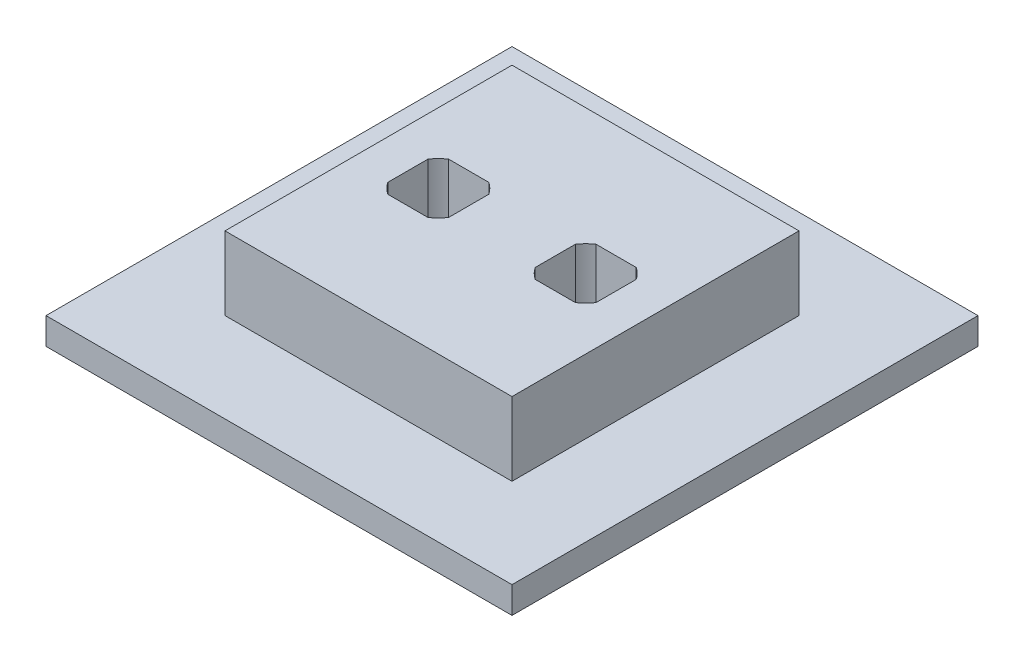
ISO-10303-21;
HEADER;
FILE_DESCRIPTION(('STEP AP214'),'2;1');
FILE_NAME('part.step','',(''),(''),'','','');
FILE_SCHEMA(('AUTOMOTIVE_DESIGN { 1 0 10303 214 1 1 1 1 }'));
ENDSEC;
DATA;
#1=APPLICATION_CONTEXT('core data for automotive mechanical design processes');
#2=APPLICATION_PROTOCOL_DEFINITION('international standard','automotive_design',2000,#1);
#3=PRODUCT_CONTEXT('',#1,'mechanical');
#4=PRODUCT('Part','Part','',(#3));
#5=PRODUCT_RELATED_PRODUCT_CATEGORY('part','',(#4));
#6=PRODUCT_DEFINITION_FORMATION('','',#4);
#7=PRODUCT_DEFINITION_CONTEXT('part definition',#1,'design');
#8=PRODUCT_DEFINITION('design','',#6,#7);
#9=PRODUCT_DEFINITION_SHAPE('','',#8);
#10=(LENGTH_UNIT() NAMED_UNIT(*) SI_UNIT(.MILLI.,.METRE.));
#11=(NAMED_UNIT(*) PLANE_ANGLE_UNIT() SI_UNIT($,.RADIAN.));
#12=(NAMED_UNIT(*) SI_UNIT($,.STERADIAN.) SOLID_ANGLE_UNIT());
#13=UNCERTAINTY_MEASURE_WITH_UNIT(LENGTH_MEASURE(1.E-05),#10,'distance_accuracy_value','');
#14=(GEOMETRIC_REPRESENTATION_CONTEXT(3) GLOBAL_UNCERTAINTY_ASSIGNED_CONTEXT((#13)) GLOBAL_UNIT_ASSIGNED_CONTEXT((#10,
#11,#12)) REPRESENTATION_CONTEXT('',''));
#15=CARTESIAN_POINT('',(0.,0.,0.));
#16=DIRECTION('',(0.,0.,1.));
#17=DIRECTION('',(1.,0.,0.));
#18=AXIS2_PLACEMENT_3D('',#15,#16,#17);
#19=CARTESIAN_POINT('',(23.876,15.,-34.925));
#20=DIRECTION('',(0.,-1.,0.));
#21=DIRECTION('',(0.,0.,-1.));
#22=AXIS2_PLACEMENT_3D('',#19,#20,#21);
#23=CYLINDRICAL_SURFACE('',#22,5.46099999999999);
#24=CARTESIAN_POINT('',(23.876,15.,-34.925));
#25=DIRECTION('',(0.,1.,0.));
#26=DIRECTION('',(0.,0.,1.));
#27=AXIS2_PLACEMENT_3D('',#24,#25,#26);
#28=CIRCLE('',#27,5.46099999999999);
#29=CARTESIAN_POINT('',(20.8727018130062,15.,-39.486));
#30=VERTEX_POINT('',#29);
#31=CARTESIAN_POINT('',(19.315,15.,-37.9282981869937));
#32=VERTEX_POINT('',#31);
#33=EDGE_CURVE('E406',#30,#32,#28,.T.);
#34=ORIENTED_EDGE('',*,*,#33,.T.);
#35=DIRECTION('',(0.,-1.,0.));
#36=VECTOR('',#35,1.);
#37=CARTESIAN_POINT('',(19.315,15.,-37.9282981869937));
#38=LINE('',#37,#36);
#39=CARTESIAN_POINT('',(19.315,0.,-37.9282981869937));
#40=VERTEX_POINT('',#39);
#41=EDGE_CURVE('E11',#32,#40,#38,.T.);
#42=ORIENTED_EDGE('',*,*,#41,.T.);
#43=CARTESIAN_POINT('',(23.876,0.,-34.925));
#44=DIRECTION('',(0.,1.,0.));
#45=DIRECTION('',(0.,0.,1.));
#46=AXIS2_PLACEMENT_3D('',#43,#44,#45);
#47=CIRCLE('',#46,5.46099999999998);
#48=CARTESIAN_POINT('',(20.8727018130063,0.,-39.486));
#49=VERTEX_POINT('',#48);
#50=EDGE_CURVE('E485',#49,#40,#47,.T.);
#51=ORIENTED_EDGE('',*,*,#50,.F.);
#52=DIRECTION('',(0.,-1.,0.));
#53=VECTOR('',#52,1.);
#54=CARTESIAN_POINT('',(20.8727018130062,15.,-39.486));
#55=LINE('',#54,#53);
#56=EDGE_CURVE('E380',#49,#30,#55,.F.);
#57=ORIENTED_EDGE('',*,*,#56,.T.);
#58=EDGE_LOOP('',(#34,#42,#51,#57));
#59=FACE_BOUND('',#58,.T.);
#60=ADVANCED_FACE('F39',(#59),#23,.F.);
#61=CARTESIAN_POINT('',(19.315,0.,-31.9217018130063));
#62=VERTEX_POINT('',#61);
#63=CARTESIAN_POINT('',(20.8727018130062,0.,-30.364));
#64=VERTEX_POINT('',#63);
#65=EDGE_CURVE('E236',#62,#64,#47,.T.);
#66=ORIENTED_EDGE('',*,*,#65,.F.);
#67=DIRECTION('',(0.,-1.,0.));
#68=VECTOR('',#67,1.);
#69=CARTESIAN_POINT('',(19.315,15.,-31.9217018130062));
#70=LINE('',#69,#68);
#71=CARTESIAN_POINT('',(19.315,15.,-31.9217018130062));
#72=VERTEX_POINT('',#71);
#73=EDGE_CURVE('E48',#62,#72,#70,.F.);
#74=ORIENTED_EDGE('',*,*,#73,.T.);
#75=CARTESIAN_POINT('',(20.8727018130062,15.,-30.364));
#76=VERTEX_POINT('',#75);
#77=EDGE_CURVE('E246',#72,#76,#28,.T.);
#78=ORIENTED_EDGE('',*,*,#77,.T.);
#79=DIRECTION('',(0.,-1.,0.));
#80=VECTOR('',#79,1.);
#81=CARTESIAN_POINT('',(20.8727018130062,15.,-30.364));
#82=LINE('',#81,#80);
#83=EDGE_CURVE('E368',#76,#64,#82,.T.);
#84=ORIENTED_EDGE('',*,*,#83,.T.);
#85=EDGE_LOOP('',(#66,#74,#78,#84));
#86=FACE_BOUND('',#85,.T.);
#87=ADVANCED_FACE('F393',(#86),#23,.F.);
#88=CARTESIAN_POINT('',(28.437,15.,-37.9282981869937));
#89=VERTEX_POINT('',#88);
#90=CARTESIAN_POINT('',(26.8792981869938,15.,-39.486));
#91=VERTEX_POINT('',#90);
#92=EDGE_CURVE('E253',#89,#91,#28,.T.);
#93=ORIENTED_EDGE('',*,*,#92,.T.);
#94=DIRECTION('',(0.,-1.,0.));
#95=VECTOR('',#94,1.);
#96=CARTESIAN_POINT('',(26.8792981869938,15.,-39.486));
#97=LINE('',#96,#95);
#98=CARTESIAN_POINT('',(26.8792981869938,0.,-39.486));
#99=VERTEX_POINT('',#98);
#100=EDGE_CURVE('E384',#91,#99,#97,.T.);
#101=ORIENTED_EDGE('',*,*,#100,.T.);
#102=CARTESIAN_POINT('',(28.437,0.,-37.9282981869937));
#103=VERTEX_POINT('',#102);
#104=EDGE_CURVE('E482',#103,#99,#47,.T.);
#105=ORIENTED_EDGE('',*,*,#104,.F.);
#106=DIRECTION('',(0.,-1.,0.));
#107=VECTOR('',#106,1.);
#108=CARTESIAN_POINT('',(28.437,15.,-37.9282981869937));
#109=LINE('',#108,#107);
#110=EDGE_CURVE('E372',#103,#89,#109,.F.);
#111=ORIENTED_EDGE('',*,*,#110,.T.);
#112=EDGE_LOOP('',(#93,#101,#105,#111));
#113=FACE_BOUND('',#112,.T.);
#114=ADVANCED_FACE('F413',(#113),#23,.F.);
#115=CARTESIAN_POINT('',(26.8792981869938,15.,-30.364));
#116=VERTEX_POINT('',#115);
#117=CARTESIAN_POINT('',(28.437,15.,-31.9217018130062));
#118=VERTEX_POINT('',#117);
#119=EDGE_CURVE('E248',#116,#118,#28,.T.);
#120=ORIENTED_EDGE('',*,*,#119,.T.);
#121=DIRECTION('',(0.,-1.,0.));
#122=VECTOR('',#121,1.);
#123=CARTESIAN_POINT('',(28.437,15.,-31.9217018130062));
#124=LINE('',#123,#122);
#125=CARTESIAN_POINT('',(28.437,0.,-31.9217018130062));
#126=VERTEX_POINT('',#125);
#127=EDGE_CURVE('E376',#118,#126,#124,.T.);
#128=ORIENTED_EDGE('',*,*,#127,.T.);
#129=CARTESIAN_POINT('',(26.8792981869937,0.,-30.364));
#130=VERTEX_POINT('',#129);
#131=EDGE_CURVE('E240',#130,#126,#47,.T.);
#132=ORIENTED_EDGE('',*,*,#131,.F.);
#133=DIRECTION('',(0.,-1.,0.));
#134=VECTOR('',#133,1.);
#135=CARTESIAN_POINT('',(26.8792981869938,15.,-30.364));
#136=LINE('',#135,#134);
#137=EDGE_CURVE('E364',#130,#116,#136,.F.);
#138=ORIENTED_EDGE('',*,*,#137,.T.);
#139=EDGE_LOOP('',(#120,#128,#132,#138));
#140=FACE_BOUND('',#139,.T.);
#141=ADVANCED_FACE('F505',(#140),#23,.F.);
#142=CARTESIAN_POINT('',(45.974,15.,-34.925));
#143=DIRECTION('',(0.,-1.,0.));
#144=DIRECTION('',(0.,0.,-1.));
#145=AXIS2_PLACEMENT_3D('',#142,#143,#144);
#146=CYLINDRICAL_SURFACE('',#145,5.46099999999998);
#147=CARTESIAN_POINT('',(45.974,15.,-34.925));
#148=DIRECTION('',(0.,1.,0.));
#149=DIRECTION('',(0.,0.,1.));
#150=AXIS2_PLACEMENT_3D('',#147,#148,#149);
#151=CIRCLE('',#150,5.46099999999998);
#152=CARTESIAN_POINT('',(42.9707018130063,15.,-39.486));
#153=VERTEX_POINT('',#152);
#154=CARTESIAN_POINT('',(41.413,15.,-37.9282981869937));
#155=VERTEX_POINT('',#154);
#156=EDGE_CURVE('E473',#153,#155,#151,.T.);
#157=ORIENTED_EDGE('',*,*,#156,.T.);
#158=DIRECTION('',(0.,-1.,0.));
#159=VECTOR('',#158,1.);
#160=CARTESIAN_POINT('',(41.413,15.,-37.9282981869937));
#161=LINE('',#160,#159);
#162=CARTESIAN_POINT('',(41.413,0.,-37.9282981869937));
#163=VERTEX_POINT('',#162);
#164=EDGE_CURVE('E360',#155,#163,#161,.T.);
#165=ORIENTED_EDGE('',*,*,#164,.T.);
#166=CARTESIAN_POINT('',(45.974,0.,-34.925));
#167=DIRECTION('',(0.,1.,0.));
#168=DIRECTION('',(0.,0.,1.));
#169=AXIS2_PLACEMENT_3D('',#166,#167,#168);
#170=CIRCLE('',#169,5.46099999999998);
#171=CARTESIAN_POINT('',(42.9707018130063,0.,-39.486));
#172=VERTEX_POINT('',#171);
#173=EDGE_CURVE('E232',#172,#163,#170,.T.);
#174=ORIENTED_EDGE('',*,*,#173,.F.);
#175=DIRECTION('',(0.,-1.,0.));
#176=VECTOR('',#175,1.);
#177=CARTESIAN_POINT('',(42.9707018130063,15.,-39.486));
#178=LINE('',#177,#176);
#179=EDGE_CURVE('E206',#172,#153,#178,.F.);
#180=ORIENTED_EDGE('',*,*,#179,.T.);
#181=EDGE_LOOP('',(#157,#165,#174,#180));
#182=FACE_BOUND('',#181,.T.);
#183=ADVANCED_FACE('F512',(#182),#146,.F.);
#184=CARTESIAN_POINT('',(41.413,0.,-31.9217018130062));
#185=VERTEX_POINT('',#184);
#186=CARTESIAN_POINT('',(42.9707018130063,0.,-30.364));
#187=VERTEX_POINT('',#186);
#188=EDGE_CURVE('E237',#185,#187,#170,.T.);
#189=ORIENTED_EDGE('',*,*,#188,.F.);
#190=DIRECTION('',(0.,-1.,0.));
#191=VECTOR('',#190,1.);
#192=CARTESIAN_POINT('',(41.413,15.,-31.9217018130062));
#193=LINE('',#192,#191);
#194=CARTESIAN_POINT('',(41.413,15.,-31.9217018130062));
#195=VERTEX_POINT('',#194);
#196=EDGE_CURVE('E224',#185,#195,#193,.F.);
#197=ORIENTED_EDGE('',*,*,#196,.T.);
#198=CARTESIAN_POINT('',(42.9707018130063,15.,-30.364));
#199=VERTEX_POINT('',#198);
#200=EDGE_CURVE('E247',#195,#199,#151,.T.);
#201=ORIENTED_EDGE('',*,*,#200,.T.);
#202=DIRECTION('',(0.,-1.,0.));
#203=VECTOR('',#202,1.);
#204=CARTESIAN_POINT('',(42.9707018130063,15.,-30.364));
#205=LINE('',#204,#203);
#206=EDGE_CURVE('E344',#199,#187,#205,.T.);
#207=ORIENTED_EDGE('',*,*,#206,.T.);
#208=EDGE_LOOP('',(#189,#197,#201,#207));
#209=FACE_BOUND('',#208,.T.);
#210=ADVANCED_FACE('F518',(#209),#146,.F.);
#211=CARTESIAN_POINT('',(50.535,15.,-37.9282981869937));
#212=VERTEX_POINT('',#211);
#213=CARTESIAN_POINT('',(48.9772981869937,15.,-39.486));
#214=VERTEX_POINT('',#213);
#215=EDGE_CURVE('E222',#212,#214,#151,.T.);
#216=ORIENTED_EDGE('',*,*,#215,.T.);
#217=DIRECTION('',(0.,-1.,0.));
#218=VECTOR('',#217,1.);
#219=CARTESIAN_POINT('',(48.9772981869937,15.,-39.486));
#220=LINE('',#219,#218);
#221=CARTESIAN_POINT('',(48.9772981869937,0.,-39.486));
#222=VERTEX_POINT('',#221);
#223=EDGE_CURVE('E203',#214,#222,#220,.T.);
#224=ORIENTED_EDGE('',*,*,#223,.T.);
#225=CARTESIAN_POINT('',(50.535,0.,-37.9282981869937));
#226=VERTEX_POINT('',#225);
#227=EDGE_CURVE('E220',#226,#222,#170,.T.);
#228=ORIENTED_EDGE('',*,*,#227,.F.);
#229=DIRECTION('',(0.,-1.,0.));
#230=VECTOR('',#229,1.);
#231=CARTESIAN_POINT('',(50.535,15.,-37.9282981869937));
#232=LINE('',#231,#230);
#233=EDGE_CURVE('E348',#226,#212,#232,.F.);
#234=ORIENTED_EDGE('',*,*,#233,.T.);
#235=EDGE_LOOP('',(#216,#224,#228,#234));
#236=FACE_BOUND('',#235,.T.);
#237=ADVANCED_FACE('F218',(#236),#146,.F.);
#238=CARTESIAN_POINT('',(48.9772981869937,15.,-30.364));
#239=VERTEX_POINT('',#238);
#240=CARTESIAN_POINT('',(50.535,15.,-31.9217018130063));
#241=VERTEX_POINT('',#240);
#242=EDGE_CURVE('E242',#239,#241,#151,.T.);
#243=ORIENTED_EDGE('',*,*,#242,.T.);
#244=DIRECTION('',(0.,-1.,0.));
#245=VECTOR('',#244,1.);
#246=CARTESIAN_POINT('',(50.535,15.,-31.9217018130063));
#247=LINE('',#246,#245);
#248=CARTESIAN_POINT('',(50.535,0.,-31.9217018130063));
#249=VERTEX_POINT('',#248);
#250=EDGE_CURVE('E351',#241,#249,#247,.T.);
#251=ORIENTED_EDGE('',*,*,#250,.T.);
#252=CARTESIAN_POINT('',(48.9772981869937,0.,-30.364));
#253=VERTEX_POINT('',#252);
#254=EDGE_CURVE('E231',#253,#249,#170,.T.);
#255=ORIENTED_EDGE('',*,*,#254,.F.);
#256=DIRECTION('',(0.,-1.,0.));
#257=VECTOR('',#256,1.);
#258=CARTESIAN_POINT('',(48.9772981869937,15.,-30.364));
#259=LINE('',#258,#257);
#260=EDGE_CURVE('E340',#253,#239,#259,.F.);
#261=ORIENTED_EDGE('',*,*,#260,.T.);
#262=EDGE_LOOP('',(#243,#251,#255,#261));
#263=FACE_BOUND('',#262,.T.);
#264=ADVANCED_FACE('F465',(#263),#146,.F.);
#265=CARTESIAN_POINT('',(0.,4.,0.));
#266=DIRECTION('',(1.,0.,0.));
#267=DIRECTION('',(0.,0.,-1.));
#268=AXIS2_PLACEMENT_3D('',#265,#266,#267);
#269=PLANE('',#268);
#270=DIRECTION('',(0.,0.,1.));
#271=VECTOR('',#270,1.);
#272=CARTESIAN_POINT('',(0.,0.,0.));
#273=LINE('',#272,#271);
#274=CARTESIAN_POINT('',(0.,0.,-69.85));
#275=VERTEX_POINT('',#274);
#276=CARTESIAN_POINT('',(0.,0.,0.));
#277=VERTEX_POINT('',#276);
#278=EDGE_CURVE('E298',#275,#277,#273,.T.);
#279=ORIENTED_EDGE('',*,*,#278,.T.);
#280=DIRECTION('',(0.,-1.,0.));
#281=VECTOR('',#280,1.);
#282=CARTESIAN_POINT('',(0.,4.,0.));
#283=LINE('',#282,#281);
#284=CARTESIAN_POINT('',(0.,4.,0.));
#285=VERTEX_POINT('',#284);
#286=EDGE_CURVE('E336',#285,#277,#283,.T.);
#287=ORIENTED_EDGE('',*,*,#286,.F.);
#288=DIRECTION('',(0.,0.,1.));
#289=VECTOR('',#288,1.);
#290=CARTESIAN_POINT('',(0.,4.,0.));
#291=LINE('',#290,#289);
#292=CARTESIAN_POINT('',(0.,4.,-69.85));
#293=VERTEX_POINT('',#292);
#294=EDGE_CURVE('E299',#293,#285,#291,.T.);
#295=ORIENTED_EDGE('',*,*,#294,.F.);
#296=DIRECTION('',(0.,-1.,0.));
#297=VECTOR('',#296,1.);
#298=CARTESIAN_POINT('',(0.,4.,-69.85));
#299=LINE('',#298,#297);
#300=EDGE_CURVE('E313',#293,#275,#299,.T.);
#301=ORIENTED_EDGE('',*,*,#300,.T.);
#302=EDGE_LOOP('',(#279,#287,#295,#301));
#303=FACE_BOUND('',#302,.T.);
#304=ADVANCED_FACE('F41',(#303),#269,.F.);
#305=CARTESIAN_POINT('',(0.,4.,0.));
#306=DIRECTION('',(0.,0.,-1.));
#307=DIRECTION('',(-1.,0.,0.));
#308=AXIS2_PLACEMENT_3D('',#305,#306,#307);
#309=PLANE('',#308);
#310=DIRECTION('',(1.,0.,0.));
#311=VECTOR('',#310,1.);
#312=CARTESIAN_POINT('',(0.,0.,0.));
#313=LINE('',#312,#311);
#314=CARTESIAN_POINT('',(69.85,0.,0.));
#315=VERTEX_POINT('',#314);
#316=EDGE_CURVE('E317',#277,#315,#313,.T.);
#317=ORIENTED_EDGE('',*,*,#316,.T.);
#318=DIRECTION('',(0.,-1.,0.));
#319=VECTOR('',#318,1.);
#320=CARTESIAN_POINT('',(69.85,4.,0.));
#321=LINE('',#320,#319);
#322=CARTESIAN_POINT('',(69.85,4.,0.));
#323=VERTEX_POINT('',#322);
#324=EDGE_CURVE('E332',#323,#315,#321,.T.);
#325=ORIENTED_EDGE('',*,*,#324,.F.);
#326=DIRECTION('',(1.,0.,0.));
#327=VECTOR('',#326,1.);
#328=CARTESIAN_POINT('',(0.,4.,0.));
#329=LINE('',#328,#327);
#330=EDGE_CURVE('E303',#285,#323,#329,.T.);
#331=ORIENTED_EDGE('',*,*,#330,.F.);
#332=ORIENTED_EDGE('',*,*,#286,.T.);
#333=EDGE_LOOP('',(#317,#325,#331,#332));
#334=FACE_BOUND('',#333,.T.);
#335=ADVANCED_FACE('F716',(#334),#309,.F.);
#336=CARTESIAN_POINT('',(69.85,4.,0.));
#337=DIRECTION('',(-1.,0.,0.));
#338=DIRECTION('',(0.,0.,1.));
#339=AXIS2_PLACEMENT_3D('',#336,#337,#338);
#340=PLANE('',#339);
#341=DIRECTION('',(0.,0.,-1.));
#342=VECTOR('',#341,1.);
#343=CARTESIAN_POINT('',(69.85,0.,0.));
#344=LINE('',#343,#342);
#345=CARTESIAN_POINT('',(69.85,0.,-69.85));
#346=VERTEX_POINT('',#345);
#347=EDGE_CURVE('E320',#315,#346,#344,.T.);
#348=ORIENTED_EDGE('',*,*,#347,.T.);
#349=DIRECTION('',(0.,-1.,0.));
#350=VECTOR('',#349,1.);
#351=CARTESIAN_POINT('',(69.85,4.,-69.85));
#352=LINE('',#351,#350);
#353=CARTESIAN_POINT('',(69.85,4.,-69.85));
#354=VERTEX_POINT('',#353);
#355=EDGE_CURVE('E328',#354,#346,#352,.T.);
#356=ORIENTED_EDGE('',*,*,#355,.F.);
#357=DIRECTION('',(0.,0.,-1.));
#358=VECTOR('',#357,1.);
#359=CARTESIAN_POINT('',(69.85,4.,0.));
#360=LINE('',#359,#358);
#361=EDGE_CURVE('E307',#323,#354,#360,.T.);
#362=ORIENTED_EDGE('',*,*,#361,.F.);
#363=ORIENTED_EDGE('',*,*,#324,.T.);
#364=EDGE_LOOP('',(#348,#356,#362,#363));
#365=FACE_BOUND('',#364,.T.);
#366=ADVANCED_FACE('F706',(#365),#340,.F.);
#367=CARTESIAN_POINT('',(0.,4.,-69.85));
#368=DIRECTION('',(0.,0.,1.));
#369=DIRECTION('',(1.,0.,0.));
#370=AXIS2_PLACEMENT_3D('',#367,#368,#369);
#371=PLANE('',#370);
#372=DIRECTION('',(-1.,0.,0.));
#373=VECTOR('',#372,1.);
#374=CARTESIAN_POINT('',(0.,0.,-69.85));
#375=LINE('',#374,#373);
#376=EDGE_CURVE('E304',#346,#275,#375,.T.);
#377=ORIENTED_EDGE('',*,*,#376,.T.);
#378=ORIENTED_EDGE('',*,*,#300,.F.);
#379=DIRECTION('',(-1.,0.,0.));
#380=VECTOR('',#379,1.);
#381=CARTESIAN_POINT('',(0.,4.,-69.85));
#382=LINE('',#381,#380);
#383=EDGE_CURVE('E310',#354,#293,#382,.T.);
#384=ORIENTED_EDGE('',*,*,#383,.F.);
#385=ORIENTED_EDGE('',*,*,#355,.T.);
#386=EDGE_LOOP('',(#377,#378,#384,#385));
#387=FACE_BOUND('',#386,.T.);
#388=ADVANCED_FACE('F696',(#387),#371,.F.);
#389=CARTESIAN_POINT('',(0.,4.,0.));
#390=DIRECTION('',(0.,-1.,0.));
#391=DIRECTION('',(0.,0.,-1.));
#392=AXIS2_PLACEMENT_3D('',#389,#390,#391);
#393=PLANE('',#392);
#394=DIRECTION('',(0.,0.,1.));
#395=VECTOR('',#394,1.);
#396=CARTESIAN_POINT('',(13.415,4.,-13.415));
#397=LINE('',#396,#395);
#398=CARTESIAN_POINT('',(13.415,4.,-56.435));
#399=VERTEX_POINT('',#398);
#400=CARTESIAN_POINT('',(13.415,4.,-13.415));
#401=VERTEX_POINT('',#400);
#402=EDGE_CURVE('E252',#399,#401,#397,.T.);
#403=ORIENTED_EDGE('',*,*,#402,.F.);
#404=DIRECTION('',(-1.,0.,0.));
#405=VECTOR('',#404,1.);
#406=CARTESIAN_POINT('',(13.415,4.,-56.435));
#407=LINE('',#406,#405);
#408=CARTESIAN_POINT('',(56.435,4.,-56.435));
#409=VERTEX_POINT('',#408);
#410=EDGE_CURVE('E259',#409,#399,#407,.T.);
#411=ORIENTED_EDGE('',*,*,#410,.F.);
#412=DIRECTION('',(0.,0.,-1.));
#413=VECTOR('',#412,1.);
#414=CARTESIAN_POINT('',(56.435,4.,-13.415));
#415=LINE('',#414,#413);
#416=CARTESIAN_POINT('',(56.435,4.,-13.415));
#417=VERTEX_POINT('',#416);
#418=EDGE_CURVE('E276',#417,#409,#415,.T.);
#419=ORIENTED_EDGE('',*,*,#418,.F.);
#420=DIRECTION('',(1.,0.,0.));
#421=VECTOR('',#420,1.);
#422=CARTESIAN_POINT('',(13.415,4.,-13.415));
#423=LINE('',#422,#421);
#424=EDGE_CURVE('E272',#401,#417,#423,.T.);
#425=ORIENTED_EDGE('',*,*,#424,.F.);
#426=EDGE_LOOP('',(#403,#411,#419,#425));
#427=FACE_BOUND('',#426,.T.);
#428=ORIENTED_EDGE('',*,*,#294,.T.);
#429=ORIENTED_EDGE('',*,*,#330,.T.);
#430=ORIENTED_EDGE('',*,*,#361,.T.);
#431=ORIENTED_EDGE('',*,*,#383,.T.);
#432=EDGE_LOOP('',(#428,#429,#430,#431));
#433=FACE_BOUND('',#432,.T.);
#434=ADVANCED_FACE('F593',(#427,#433),#393,.F.);
#435=CARTESIAN_POINT('',(0.,0.,0.));
#436=DIRECTION('',(0.,-1.,0.));
#437=DIRECTION('',(0.,0.,-1.));
#438=AXIS2_PLACEMENT_3D('',#435,#436,#437);
#439=PLANE('',#438);
#440=ORIENTED_EDGE('',*,*,#278,.F.);
#441=ORIENTED_EDGE('',*,*,#376,.F.);
#442=ORIENTED_EDGE('',*,*,#347,.F.);
#443=ORIENTED_EDGE('',*,*,#316,.F.);
#444=EDGE_LOOP('',(#440,#441,#442,#443));
#445=FACE_BOUND('',#444,.T.);
#446=DIRECTION('',(0.,0.,1.));
#447=VECTOR('',#446,1.);
#448=CARTESIAN_POINT('',(19.315,0.,-30.364));
#449=LINE('',#448,#447);
#450=EDGE_CURVE('E55',#40,#62,#449,.T.);
#451=ORIENTED_EDGE('',*,*,#450,.T.);
#452=ORIENTED_EDGE('',*,*,#65,.T.);
#453=DIRECTION('',(1.,0.,0.));
#454=VECTOR('',#453,1.);
#455=CARTESIAN_POINT('',(19.315,0.,-30.364));
#456=LINE('',#455,#454);
#457=EDGE_CURVE('E443',#64,#130,#456,.T.);
#458=ORIENTED_EDGE('',*,*,#457,.T.);
#459=ORIENTED_EDGE('',*,*,#131,.T.);
#460=DIRECTION('',(0.,0.,-1.));
#461=VECTOR('',#460,1.);
#462=CARTESIAN_POINT('',(28.437,0.,-30.364));
#463=LINE('',#462,#461);
#464=EDGE_CURVE('E446',#126,#103,#463,.T.);
#465=ORIENTED_EDGE('',*,*,#464,.T.);
#466=ORIENTED_EDGE('',*,*,#104,.T.);
#467=DIRECTION('',(-1.,0.,0.));
#468=VECTOR('',#467,1.);
#469=CARTESIAN_POINT('',(19.315,0.,-39.486));
#470=LINE('',#469,#468);
#471=EDGE_CURVE('E61',#99,#49,#470,.T.);
#472=ORIENTED_EDGE('',*,*,#471,.T.);
#473=ORIENTED_EDGE('',*,*,#50,.T.);
#474=EDGE_LOOP('',(#451,#452,#458,#459,#465,#466,#472,#473));
#475=FACE_BOUND('',#474,.T.);
#476=DIRECTION('',(0.,0.,1.));
#477=VECTOR('',#476,1.);
#478=CARTESIAN_POINT('',(41.413,0.,-39.486));
#479=LINE('',#478,#477);
#480=EDGE_CURVE('E212',#163,#185,#479,.T.);
#481=ORIENTED_EDGE('',*,*,#480,.T.);
#482=ORIENTED_EDGE('',*,*,#188,.T.);
#483=DIRECTION('',(1.,0.,0.));
#484=VECTOR('',#483,1.);
#485=CARTESIAN_POINT('',(41.413,0.,-30.364));
#486=LINE('',#485,#484);
#487=EDGE_CURVE('E450',#187,#253,#486,.T.);
#488=ORIENTED_EDGE('',*,*,#487,.T.);
#489=ORIENTED_EDGE('',*,*,#254,.T.);
#490=DIRECTION('',(0.,0.,-1.));
#491=VECTOR('',#490,1.);
#492=CARTESIAN_POINT('',(50.535,0.,-39.486));
#493=LINE('',#492,#491);
#494=EDGE_CURVE('E228',#249,#226,#493,.T.);
#495=ORIENTED_EDGE('',*,*,#494,.T.);
#496=ORIENTED_EDGE('',*,*,#227,.T.);
#497=DIRECTION('',(-1.,0.,0.));
#498=VECTOR('',#497,1.);
#499=CARTESIAN_POINT('',(41.413,0.,-39.486));
#500=LINE('',#499,#498);
#501=EDGE_CURVE('E200',#222,#172,#500,.T.);
#502=ORIENTED_EDGE('',*,*,#501,.T.);
#503=ORIENTED_EDGE('',*,*,#173,.T.);
#504=EDGE_LOOP('',(#481,#482,#488,#489,#495,#496,#502,#503));
#505=FACE_BOUND('',#504,.T.);
#506=ADVANCED_FACE('F226',(#445,#475,#505),#439,.T.);
#507=CARTESIAN_POINT('',(0.,15.,0.));
#508=DIRECTION('',(0.,-1.,0.));
#509=DIRECTION('',(0.,0.,-1.));
#510=AXIS2_PLACEMENT_3D('',#507,#508,#509);
#511=PLANE('',#510);
#512=ORIENTED_EDGE('',*,*,#77,.F.);
#513=DIRECTION('',(0.,0.,1.));
#514=VECTOR('',#513,1.);
#515=CARTESIAN_POINT('',(19.315,15.,-30.364));
#516=LINE('',#515,#514);
#517=EDGE_CURVE('E401',#32,#72,#516,.T.);
#518=ORIENTED_EDGE('',*,*,#517,.F.);
#519=ORIENTED_EDGE('',*,*,#33,.F.);
#520=DIRECTION('',(-1.,0.,0.));
#521=VECTOR('',#520,1.);
#522=CARTESIAN_POINT('',(19.315,15.,-39.486));
#523=LINE('',#522,#521);
#524=EDGE_CURVE('E419',#91,#30,#523,.T.);
#525=ORIENTED_EDGE('',*,*,#524,.F.);
#526=ORIENTED_EDGE('',*,*,#92,.F.);
#527=DIRECTION('',(0.,0.,-1.));
#528=VECTOR('',#527,1.);
#529=CARTESIAN_POINT('',(28.437,15.,-30.364));
#530=LINE('',#529,#528);
#531=EDGE_CURVE('E418',#118,#89,#530,.T.);
#532=ORIENTED_EDGE('',*,*,#531,.F.);
#533=ORIENTED_EDGE('',*,*,#119,.F.);
#534=DIRECTION('',(1.,0.,0.));
#535=VECTOR('',#534,1.);
#536=CARTESIAN_POINT('',(19.315,15.,-30.364));
#537=LINE('',#536,#535);
#538=EDGE_CURVE('E404',#76,#116,#537,.T.);
#539=ORIENTED_EDGE('',*,*,#538,.F.);
#540=EDGE_LOOP('',(#512,#518,#519,#525,#526,#532,#533,#539));
#541=FACE_BOUND('',#540,.T.);
#542=ORIENTED_EDGE('',*,*,#200,.F.);
#543=DIRECTION('',(0.,0.,1.));
#544=VECTOR('',#543,1.);
#545=CARTESIAN_POINT('',(41.413,15.,-39.486));
#546=LINE('',#545,#544);
#547=EDGE_CURVE('E429',#155,#195,#546,.T.);
#548=ORIENTED_EDGE('',*,*,#547,.F.);
#549=ORIENTED_EDGE('',*,*,#156,.F.);
#550=DIRECTION('',(-1.,0.,0.));
#551=VECTOR('',#550,1.);
#552=CARTESIAN_POINT('',(41.413,15.,-39.486));
#553=LINE('',#552,#551);
#554=EDGE_CURVE('E431',#214,#153,#553,.T.);
#555=ORIENTED_EDGE('',*,*,#554,.F.);
#556=ORIENTED_EDGE('',*,*,#215,.F.);
#557=DIRECTION('',(0.,0.,-1.));
#558=VECTOR('',#557,1.);
#559=CARTESIAN_POINT('',(50.535,15.,-39.486));
#560=LINE('',#559,#558);
#561=EDGE_CURVE('E434',#241,#212,#560,.T.);
#562=ORIENTED_EDGE('',*,*,#561,.F.);
#563=ORIENTED_EDGE('',*,*,#242,.F.);
#564=DIRECTION('',(1.,0.,0.));
#565=VECTOR('',#564,1.);
#566=CARTESIAN_POINT('',(41.413,15.,-30.364));
#567=LINE('',#566,#565);
#568=EDGE_CURVE('E213',#199,#239,#567,.T.);
#569=ORIENTED_EDGE('',*,*,#568,.F.);
#570=EDGE_LOOP('',(#542,#548,#549,#555,#556,#562,#563,#569));
#571=FACE_BOUND('',#570,.T.);
#572=DIRECTION('',(0.,0.,1.));
#573=VECTOR('',#572,1.);
#574=CARTESIAN_POINT('',(13.415,15.,-13.415));
#575=LINE('',#574,#573);
#576=CARTESIAN_POINT('',(13.415,15.,-56.435));
#577=VERTEX_POINT('',#576);
#578=CARTESIAN_POINT('',(13.415,15.,-13.415));
#579=VERTEX_POINT('',#578);
#580=EDGE_CURVE('E254',#577,#579,#575,.T.);
#581=ORIENTED_EDGE('',*,*,#580,.T.);
#582=DIRECTION('',(1.,0.,0.));
#583=VECTOR('',#582,1.);
#584=CARTESIAN_POINT('',(13.415,15.,-13.415));
#585=LINE('',#584,#583);
#586=CARTESIAN_POINT('',(56.435,15.,-13.415));
#587=VERTEX_POINT('',#586);
#588=EDGE_CURVE('E258',#579,#587,#585,.T.);
#589=ORIENTED_EDGE('',*,*,#588,.T.);
#590=DIRECTION('',(0.,0.,-1.));
#591=VECTOR('',#590,1.);
#592=CARTESIAN_POINT('',(56.435,15.,-13.415));
#593=LINE('',#592,#591);
#594=CARTESIAN_POINT('',(56.435,15.,-56.435));
#595=VERTEX_POINT('',#594);
#596=EDGE_CURVE('E262',#587,#595,#593,.T.);
#597=ORIENTED_EDGE('',*,*,#596,.T.);
#598=DIRECTION('',(-1.,0.,0.));
#599=VECTOR('',#598,1.);
#600=CARTESIAN_POINT('',(13.415,15.,-56.435));
#601=LINE('',#600,#599);
#602=EDGE_CURVE('E265',#595,#577,#601,.T.);
#603=ORIENTED_EDGE('',*,*,#602,.T.);
#604=EDGE_LOOP('',(#581,#589,#597,#603));
#605=FACE_BOUND('',#604,.T.);
#606=ADVANCED_FACE('F398',(#541,#571,#605),#511,.F.);
#607=CARTESIAN_POINT('',(13.415,15.,-13.415));
#608=DIRECTION('',(1.,0.,0.));
#609=DIRECTION('',(0.,0.,-1.));
#610=AXIS2_PLACEMENT_3D('',#607,#608,#609);
#611=PLANE('',#610);
#612=ORIENTED_EDGE('',*,*,#402,.T.);
#613=DIRECTION('',(0.,-1.,0.));
#614=VECTOR('',#613,1.);
#615=CARTESIAN_POINT('',(13.415,15.,-13.415));
#616=LINE('',#615,#614);
#617=EDGE_CURVE('E294',#579,#401,#616,.T.);
#618=ORIENTED_EDGE('',*,*,#617,.F.);
#619=ORIENTED_EDGE('',*,*,#580,.F.);
#620=DIRECTION('',(0.,-1.,0.));
#621=VECTOR('',#620,1.);
#622=CARTESIAN_POINT('',(13.415,15.,-56.435));
#623=LINE('',#622,#621);
#624=EDGE_CURVE('E268',#577,#399,#623,.T.);
#625=ORIENTED_EDGE('',*,*,#624,.T.);
#626=EDGE_LOOP('',(#612,#618,#619,#625));
#627=FACE_BOUND('',#626,.T.);
#628=ADVANCED_FACE('F583',(#627),#611,.F.);
#629=CARTESIAN_POINT('',(13.415,15.,-13.415));
#630=DIRECTION('',(0.,0.,-1.));
#631=DIRECTION('',(-1.,0.,0.));
#632=AXIS2_PLACEMENT_3D('',#629,#630,#631);
#633=PLANE('',#632);
#634=ORIENTED_EDGE('',*,*,#424,.T.);
#635=DIRECTION('',(0.,-1.,0.));
#636=VECTOR('',#635,1.);
#637=CARTESIAN_POINT('',(56.435,15.,-13.415));
#638=LINE('',#637,#636);
#639=EDGE_CURVE('E290',#587,#417,#638,.T.);
#640=ORIENTED_EDGE('',*,*,#639,.F.);
#641=ORIENTED_EDGE('',*,*,#588,.F.);
#642=ORIENTED_EDGE('',*,*,#617,.T.);
#643=EDGE_LOOP('',(#634,#640,#641,#642));
#644=FACE_BOUND('',#643,.T.);
#645=ADVANCED_FACE('F670',(#644),#633,.F.);
#646=CARTESIAN_POINT('',(56.435,15.,-13.415));
#647=DIRECTION('',(-1.,0.,0.));
#648=DIRECTION('',(0.,0.,1.));
#649=AXIS2_PLACEMENT_3D('',#646,#647,#648);
#650=PLANE('',#649);
#651=ORIENTED_EDGE('',*,*,#418,.T.);
#652=DIRECTION('',(0.,-1.,0.));
#653=VECTOR('',#652,1.);
#654=CARTESIAN_POINT('',(56.435,15.,-56.435));
#655=LINE('',#654,#653);
#656=EDGE_CURVE('E286',#595,#409,#655,.T.);
#657=ORIENTED_EDGE('',*,*,#656,.F.);
#658=ORIENTED_EDGE('',*,*,#596,.F.);
#659=ORIENTED_EDGE('',*,*,#639,.T.);
#660=EDGE_LOOP('',(#651,#657,#658,#659));
#661=FACE_BOUND('',#660,.T.);
#662=ADVANCED_FACE('F660',(#661),#650,.F.);
#663=CARTESIAN_POINT('',(13.415,15.,-56.435));
#664=DIRECTION('',(0.,0.,1.));
#665=DIRECTION('',(1.,0.,0.));
#666=AXIS2_PLACEMENT_3D('',#663,#664,#665);
#667=PLANE('',#666);
#668=ORIENTED_EDGE('',*,*,#410,.T.);
#669=ORIENTED_EDGE('',*,*,#624,.F.);
#670=ORIENTED_EDGE('',*,*,#602,.F.);
#671=ORIENTED_EDGE('',*,*,#656,.T.);
#672=EDGE_LOOP('',(#668,#669,#670,#671));
#673=FACE_BOUND('',#672,.T.);
#674=ADVANCED_FACE('F573',(#673),#667,.F.);
#675=CARTESIAN_POINT('',(41.413,-60.8394674532905,-39.486));
#676=DIRECTION('',(0.,0.,-1.));
#677=DIRECTION('',(-1.,0.,0.));
#678=AXIS2_PLACEMENT_3D('',#675,#676,#677);
#679=PLANE('',#678);
#680=ORIENTED_EDGE('',*,*,#223,.F.);
#681=ORIENTED_EDGE('',*,*,#554,.T.);
#682=ORIENTED_EDGE('',*,*,#179,.F.);
#683=ORIENTED_EDGE('',*,*,#501,.F.);
#684=EDGE_LOOP('',(#680,#681,#682,#683));
#685=FACE_BOUND('',#684,.T.);
#686=ADVANCED_FACE('F202',(#685),#679,.F.);
#687=CARTESIAN_POINT('',(41.413,-60.8394674532905,-39.486));
#688=DIRECTION('',(-1.,0.,0.));
#689=DIRECTION('',(0.,0.,1.));
#690=AXIS2_PLACEMENT_3D('',#687,#688,#689);
#691=PLANE('',#690);
#692=ORIENTED_EDGE('',*,*,#164,.F.);
#693=ORIENTED_EDGE('',*,*,#547,.T.);
#694=ORIENTED_EDGE('',*,*,#196,.F.);
#695=ORIENTED_EDGE('',*,*,#480,.F.);
#696=EDGE_LOOP('',(#692,#693,#694,#695));
#697=FACE_BOUND('',#696,.T.);
#698=ADVANCED_FACE('F556',(#697),#691,.F.);
#699=CARTESIAN_POINT('',(41.413,-60.8394674532905,-30.364));
#700=DIRECTION('',(0.,0.,1.));
#701=DIRECTION('',(1.,0.,0.));
#702=AXIS2_PLACEMENT_3D('',#699,#700,#701);
#703=PLANE('',#702);
#704=ORIENTED_EDGE('',*,*,#206,.F.);
#705=ORIENTED_EDGE('',*,*,#568,.T.);
#706=ORIENTED_EDGE('',*,*,#260,.F.);
#707=ORIENTED_EDGE('',*,*,#487,.F.);
#708=EDGE_LOOP('',(#704,#705,#706,#707));
#709=FACE_BOUND('',#708,.T.);
#710=ADVANCED_FACE('F461',(#709),#703,.F.);
#711=CARTESIAN_POINT('',(50.535,-60.8394674532905,-39.486));
#712=DIRECTION('',(1.,0.,0.));
#713=DIRECTION('',(0.,0.,-1.));
#714=AXIS2_PLACEMENT_3D('',#711,#712,#713);
#715=PLANE('',#714);
#716=ORIENTED_EDGE('',*,*,#250,.F.);
#717=ORIENTED_EDGE('',*,*,#561,.T.);
#718=ORIENTED_EDGE('',*,*,#233,.F.);
#719=ORIENTED_EDGE('',*,*,#494,.F.);
#720=EDGE_LOOP('',(#716,#717,#718,#719));
#721=FACE_BOUND('',#720,.T.);
#722=ADVANCED_FACE('F468',(#721),#715,.F.);
#723=CARTESIAN_POINT('',(19.315,-60.8394674532905,-39.486));
#724=DIRECTION('',(0.,0.,-1.));
#725=DIRECTION('',(-1.,0.,0.));
#726=AXIS2_PLACEMENT_3D('',#723,#724,#725);
#727=PLANE('',#726);
#728=ORIENTED_EDGE('',*,*,#100,.F.);
#729=ORIENTED_EDGE('',*,*,#524,.T.);
#730=ORIENTED_EDGE('',*,*,#56,.F.);
#731=ORIENTED_EDGE('',*,*,#471,.F.);
#732=EDGE_LOOP('',(#728,#729,#730,#731));
#733=FACE_BOUND('',#732,.T.);
#734=ADVANCED_FACE('F492',(#733),#727,.F.);
#735=CARTESIAN_POINT('',(19.315,-60.8394674532905,-30.364));
#736=DIRECTION('',(-1.,0.,0.));
#737=DIRECTION('',(0.,0.,1.));
#738=AXIS2_PLACEMENT_3D('',#735,#736,#737);
#739=PLANE('',#738);
#740=ORIENTED_EDGE('',*,*,#41,.F.);
#741=ORIENTED_EDGE('',*,*,#517,.T.);
#742=ORIENTED_EDGE('',*,*,#73,.F.);
#743=ORIENTED_EDGE('',*,*,#450,.F.);
#744=EDGE_LOOP('',(#740,#741,#742,#743));
#745=FACE_BOUND('',#744,.T.);
#746=ADVANCED_FACE('F489',(#745),#739,.F.);
#747=CARTESIAN_POINT('',(19.315,-60.8394674532905,-30.364));
#748=DIRECTION('',(0.,0.,1.));
#749=DIRECTION('',(1.,0.,0.));
#750=AXIS2_PLACEMENT_3D('',#747,#748,#749);
#751=PLANE('',#750);
#752=ORIENTED_EDGE('',*,*,#83,.F.);
#753=ORIENTED_EDGE('',*,*,#538,.T.);
#754=ORIENTED_EDGE('',*,*,#137,.F.);
#755=ORIENTED_EDGE('',*,*,#457,.F.);
#756=EDGE_LOOP('',(#752,#753,#754,#755));
#757=FACE_BOUND('',#756,.T.);
#758=ADVANCED_FACE('F491',(#757),#751,.F.);
#759=CARTESIAN_POINT('',(28.437,-60.8394674532905,-30.364));
#760=DIRECTION('',(1.,0.,0.));
#761=DIRECTION('',(0.,0.,-1.));
#762=AXIS2_PLACEMENT_3D('',#759,#760,#761);
#763=PLANE('',#762);
#764=ORIENTED_EDGE('',*,*,#127,.F.);
#765=ORIENTED_EDGE('',*,*,#531,.T.);
#766=ORIENTED_EDGE('',*,*,#110,.F.);
#767=ORIENTED_EDGE('',*,*,#464,.F.);
#768=EDGE_LOOP('',(#764,#765,#766,#767));
#769=FACE_BOUND('',#768,.T.);
#770=ADVANCED_FACE('F498',(#769),#763,.F.);
#771=CLOSED_SHELL('',(#60,#87,#114,#141,#183,#210,#237,#264,#304,#335,#366,#388,#434,#506,#606,
#628,#645,#662,#674,#686,#698,#710,#722,#734,#746,#758,#770));
#772=MANIFOLD_SOLID_BREP('B2',#771);
#773=ADVANCED_BREP_SHAPE_REPRESENTATION('',(#18,#772),#14);
#774=SHAPE_DEFINITION_REPRESENTATION(#9,#773);
ENDSEC;
END-ISO-10303-21;
